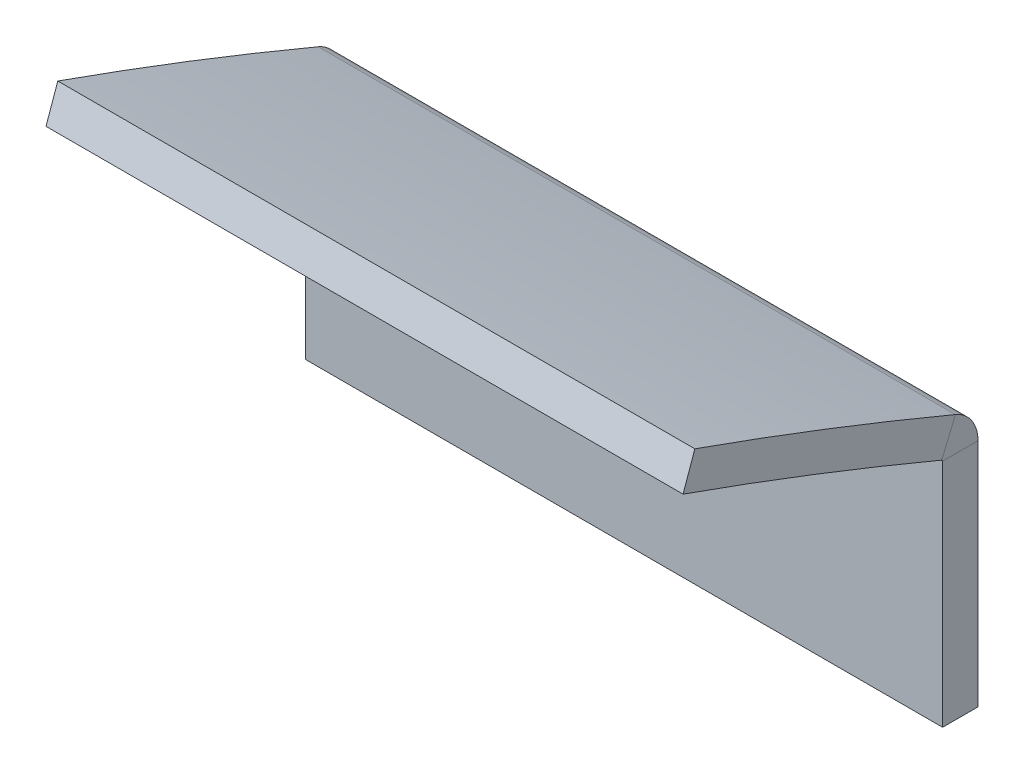
ISO-10303-21;
HEADER;
FILE_DESCRIPTION(('STEP AP214'),'2;1');
FILE_NAME('part.step','',(''),(''),'','','');
FILE_SCHEMA(('AUTOMOTIVE_DESIGN { 1 0 10303 214 1 1 1 1 }'));
ENDSEC;
DATA;
#1=APPLICATION_CONTEXT('core data for automotive mechanical design processes');
#2=APPLICATION_PROTOCOL_DEFINITION('international standard','automotive_design',2000,#1);
#3=PRODUCT_CONTEXT('',#1,'mechanical');
#4=PRODUCT('Part','Part','',(#3));
#5=PRODUCT_RELATED_PRODUCT_CATEGORY('part','',(#4));
#6=PRODUCT_DEFINITION_FORMATION('','',#4);
#7=PRODUCT_DEFINITION_CONTEXT('part definition',#1,'design');
#8=PRODUCT_DEFINITION('design','',#6,#7);
#9=PRODUCT_DEFINITION_SHAPE('','',#8);
#10=(LENGTH_UNIT() NAMED_UNIT(*) SI_UNIT(.MILLI.,.METRE.));
#11=(NAMED_UNIT(*) PLANE_ANGLE_UNIT() SI_UNIT($,.RADIAN.));
#12=(NAMED_UNIT(*) SI_UNIT($,.STERADIAN.) SOLID_ANGLE_UNIT());
#13=UNCERTAINTY_MEASURE_WITH_UNIT(LENGTH_MEASURE(1.E-05),#10,'distance_accuracy_value','');
#14=(GEOMETRIC_REPRESENTATION_CONTEXT(3) GLOBAL_UNCERTAINTY_ASSIGNED_CONTEXT((#13)) GLOBAL_UNIT_ASSIGNED_CONTEXT((#10,
#11,#12)) REPRESENTATION_CONTEXT('',''));
#15=CARTESIAN_POINT('',(0.,0.,0.));
#16=DIRECTION('',(0.,0.,1.));
#17=DIRECTION('',(1.,0.,0.));
#18=AXIS2_PLACEMENT_3D('',#15,#16,#17);
#19=CARTESIAN_POINT('',(14.2875,11.1016906738713,-5.58799999999883));
#20=DIRECTION('',(1.,0.,0.));
#21=DIRECTION('',(0.,0.,-1.));
#22=AXIS2_PLACEMENT_3D('',#19,#20,#21);
#23=PLANE('',#22);
#24=DIRECTION('',(0.,0.,1.));
#25=VECTOR('',#24,1.);
#26=CARTESIAN_POINT('',(14.2875,11.1016906738713,-5.58799999999883));
#27=LINE('',#26,#25);
#28=CARTESIAN_POINT('',(14.2875,11.1016906738713,-5.58799999999883));
#29=VERTEX_POINT('',#28);
#30=CARTESIAN_POINT('',(14.2875,11.1016906738713,-4.00049999999882));
#31=VERTEX_POINT('',#30);
#32=EDGE_CURVE('E11',#29,#31,#27,.T.);
#33=ORIENTED_EDGE('',*,*,#32,.F.);
#34=CARTESIAN_POINT('',(14.2875,11.1016906738713,-3.93699999999886));
#35=DIRECTION('',(1.,0.,0.));
#36=DIRECTION('',(0.,0.,-1.));
#37=AXIS2_PLACEMENT_3D('',#34,#35,#36);
#38=CIRCLE('',#37,1.65099999999996);
#39=CARTESIAN_POINT('',(14.2875,12.6242365890948,-4.57547861047536));
#40=VERTEX_POINT('',#39);
#41=EDGE_CURVE('E125',#29,#40,#38,.T.);
#42=ORIENTED_EDGE('',*,*,#41,.T.);
#43=DIRECTION('',(0.,-0.922196193351649,0.386722356436408));
#44=VECTOR('',#43,1.);
#45=CARTESIAN_POINT('',(14.2875,12.6242365890948,-4.57547861047536));
#46=LINE('',#45,#44);
#47=CARTESIAN_POINT('',(14.2875,11.1602501321491,-3.96155686963257));
#48=VERTEX_POINT('',#47);
#49=EDGE_CURVE('E51',#40,#48,#46,.T.);
#50=ORIENTED_EDGE('',*,*,#49,.T.);
#51=CARTESIAN_POINT('',(14.2875,11.1016906738713,-3.93699999999886));
#52=DIRECTION('',(1.,0.,0.));
#53=DIRECTION('',(0.,0.,-1.));
#54=AXIS2_PLACEMENT_3D('',#51,#52,#53);
#55=CIRCLE('',#54,0.0634999999999646);
#56=EDGE_CURVE('E132',#31,#48,#55,.T.);
#57=ORIENTED_EDGE('',*,*,#56,.F.);
#58=EDGE_LOOP('',(#33,#42,#50,#57));
#59=FACE_BOUND('',#58,.T.);
#60=ADVANCED_FACE('F35',(#59),#23,.T.);
#61=CARTESIAN_POINT('',(-14.2875,11.1016906738713,-4.00049999999882));
#62=DIRECTION('',(-1.,0.,0.));
#63=DIRECTION('',(0.,0.,1.));
#64=AXIS2_PLACEMENT_3D('',#61,#62,#63);
#65=PLANE('',#64);
#66=DIRECTION('',(0.,0.,-1.));
#67=VECTOR('',#66,1.);
#68=CARTESIAN_POINT('',(-14.2875,11.1016906738713,-4.00049999999882));
#69=LINE('',#68,#67);
#70=CARTESIAN_POINT('',(-14.2875,11.1016906738713,-4.00049999999882));
#71=VERTEX_POINT('',#70);
#72=CARTESIAN_POINT('',(-14.2875,11.1016906738713,-5.58799999999883));
#73=VERTEX_POINT('',#72);
#74=EDGE_CURVE('E43',#71,#73,#69,.T.);
#75=ORIENTED_EDGE('',*,*,#74,.F.);
#76=CARTESIAN_POINT('',(-14.2875,11.1016906738713,-3.93699999999886));
#77=DIRECTION('',(1.,0.,0.));
#78=DIRECTION('',(0.,0.,-1.));
#79=AXIS2_PLACEMENT_3D('',#76,#77,#78);
#80=CIRCLE('',#79,0.0634999999999646);
#81=CARTESIAN_POINT('',(-14.2875,11.1602501321491,-3.96155686963257));
#82=VERTEX_POINT('',#81);
#83=EDGE_CURVE('E147',#71,#82,#80,.T.);
#84=ORIENTED_EDGE('',*,*,#83,.T.);
#85=DIRECTION('',(0.,0.922196193351649,-0.386722356436408));
#86=VECTOR('',#85,1.);
#87=CARTESIAN_POINT('',(-14.2875,11.1602501321491,-3.96155686963257));
#88=LINE('',#87,#86);
#89=CARTESIAN_POINT('',(-14.2875,12.6242365890948,-4.57547861047536));
#90=VERTEX_POINT('',#89);
#91=EDGE_CURVE('E86',#82,#90,#88,.T.);
#92=ORIENTED_EDGE('',*,*,#91,.T.);
#93=CARTESIAN_POINT('',(-14.2875,11.1016906738713,-3.93699999999886));
#94=DIRECTION('',(1.,0.,0.));
#95=DIRECTION('',(0.,0.,-1.));
#96=AXIS2_PLACEMENT_3D('',#93,#94,#95);
#97=CIRCLE('',#96,1.65099999999996);
#98=EDGE_CURVE('E154',#73,#90,#97,.T.);
#99=ORIENTED_EDGE('',*,*,#98,.F.);
#100=EDGE_LOOP('',(#75,#84,#92,#99));
#101=FACE_BOUND('',#100,.T.);
#102=ADVANCED_FACE('F201',(#101),#65,.T.);
#103=CARTESIAN_POINT('',(14.2875,12.6242365890948,-4.57547861047536));
#104=DIRECTION('',(1.,0.,0.));
#105=DIRECTION('',(0.,0.,-1.));
#106=AXIS2_PLACEMENT_3D('',#103,#104,#105);
#107=PLANE('',#106);
#108=ORIENTED_EDGE('',*,*,#49,.F.);
#109=CARTESIAN_POINT('',(14.2875,-189.082246341472,80.0100000000011));
#110=DIRECTION('',(1.,0.,0.));
#111=DIRECTION('',(0.,0.,-1.));
#112=AXIS2_PLACEMENT_3D('',#109,#110,#111);
#113=CIRCLE('',#112,218.724046341463);
#114=CARTESIAN_POINT('',(14.2875,17.136302882361,7.11200000000116));
#115=VERTEX_POINT('',#114);
#116=EDGE_CURVE('E92',#40,#115,#113,.T.);
#117=ORIENTED_EDGE('',*,*,#116,.T.);
#118=DIRECTION('',(0.,0.94282522965899,-0.333287542999245));
#119=VECTOR('',#118,1.);
#120=CARTESIAN_POINT('',(14.2875,15.6395678302773,7.64109397451246));
#121=LINE('',#120,#119);
#122=CARTESIAN_POINT('',(14.2875,15.6395678302773,7.64109397451246));
#123=VERTEX_POINT('',#122);
#124=EDGE_CURVE('E185',#123,#115,#121,.T.);
#125=ORIENTED_EDGE('',*,*,#124,.F.);
#126=CARTESIAN_POINT('',(14.2875,-189.082246341472,80.0100000000011));
#127=DIRECTION('',(1.,0.,0.));
#128=DIRECTION('',(0.,0.,-1.));
#129=AXIS2_PLACEMENT_3D('',#126,#127,#128);
#130=CIRCLE('',#129,217.136546341463);
#131=EDGE_CURVE('E180',#48,#123,#130,.T.);
#132=ORIENTED_EDGE('',*,*,#131,.F.);
#133=EDGE_LOOP('',(#108,#117,#125,#132));
#134=FACE_BOUND('',#133,.T.);
#135=ADVANCED_FACE('F183',(#134),#107,.T.);
#136=CARTESIAN_POINT('',(-14.2875,11.1602501321491,-3.96155686963257));
#137=DIRECTION('',(-1.,0.,0.));
#138=DIRECTION('',(0.,0.,1.));
#139=AXIS2_PLACEMENT_3D('',#136,#137,#138);
#140=PLANE('',#139);
#141=ORIENTED_EDGE('',*,*,#91,.F.);
#142=CARTESIAN_POINT('',(-14.2875,-189.082246341472,80.0100000000011));
#143=DIRECTION('',(1.,0.,0.));
#144=DIRECTION('',(0.,0.,-1.));
#145=AXIS2_PLACEMENT_3D('',#142,#143,#144);
#146=CIRCLE('',#145,217.136546341463);
#147=CARTESIAN_POINT('',(-14.2875,15.6395678302773,7.64109397451246));
#148=VERTEX_POINT('',#147);
#149=EDGE_CURVE('E144',#82,#148,#146,.T.);
#150=ORIENTED_EDGE('',*,*,#149,.T.);
#151=DIRECTION('',(0.,0.94282522965899,-0.333287542999245));
#152=VECTOR('',#151,1.);
#153=CARTESIAN_POINT('',(-14.2875,15.6395678302773,7.64109397451246));
#154=LINE('',#153,#152);
#155=CARTESIAN_POINT('',(-14.2875,17.136302882361,7.11200000000116));
#156=VERTEX_POINT('',#155);
#157=EDGE_CURVE('E141',#148,#156,#154,.T.);
#158=ORIENTED_EDGE('',*,*,#157,.T.);
#159=CARTESIAN_POINT('',(-14.2875,-189.082246341472,80.0100000000011));
#160=DIRECTION('',(1.,0.,0.));
#161=DIRECTION('',(0.,0.,-1.));
#162=AXIS2_PLACEMENT_3D('',#159,#160,#161);
#163=CIRCLE('',#162,218.724046341463);
#164=EDGE_CURVE('E138',#90,#156,#163,.T.);
#165=ORIENTED_EDGE('',*,*,#164,.F.);
#166=EDGE_LOOP('',(#141,#150,#158,#165));
#167=FACE_BOUND('',#166,.T.);
#168=ADVANCED_FACE('F196',(#167),#140,.T.);
#169=CARTESIAN_POINT('',(14.2875,-189.082246341472,80.0100000000011));
#170=DIRECTION('',(-1.,0.,0.));
#171=DIRECTION('',(0.,0.,1.));
#172=AXIS2_PLACEMENT_3D('',#169,#170,#171);
#173=CYLINDRICAL_SURFACE('',#172,218.724046341463);
#174=ORIENTED_EDGE('',*,*,#164,.T.);
#175=DIRECTION('',(-1.,0.,0.));
#176=VECTOR('',#175,1.);
#177=CARTESIAN_POINT('',(14.2875,17.136302882361,7.11200000000116));
#178=LINE('',#177,#176);
#179=EDGE_CURVE('E168',#115,#156,#178,.T.);
#180=ORIENTED_EDGE('',*,*,#179,.F.);
#181=ORIENTED_EDGE('',*,*,#116,.F.);
#182=DIRECTION('',(-1.,0.,0.));
#183=VECTOR('',#182,1.);
#184=CARTESIAN_POINT('',(14.2875,12.6242365890948,-4.57547861047536));
#185=LINE('',#184,#183);
#186=EDGE_CURVE('E137',#40,#90,#185,.T.);
#187=ORIENTED_EDGE('',*,*,#186,.T.);
#188=EDGE_LOOP('',(#174,#180,#181,#187));
#189=FACE_BOUND('',#188,.T.);
#190=ADVANCED_FACE('F198',(#189),#173,.T.);
#191=CARTESIAN_POINT('',(14.2875,15.6395678302773,7.64109397451246));
#192=DIRECTION('',(0.,0.333287542999245,0.94282522965899));
#193=DIRECTION('',(0.,-0.94282522965899,0.333287542999245));
#194=AXIS2_PLACEMENT_3D('',#191,#192,#193);
#195=PLANE('',#194);
#196=ORIENTED_EDGE('',*,*,#157,.F.);
#197=DIRECTION('',(-1.,0.,0.));
#198=VECTOR('',#197,1.);
#199=CARTESIAN_POINT('',(14.2875,15.6395678302773,7.64109397451246));
#200=LINE('',#199,#198);
#201=EDGE_CURVE('E166',#123,#148,#200,.T.);
#202=ORIENTED_EDGE('',*,*,#201,.F.);
#203=ORIENTED_EDGE('',*,*,#124,.T.);
#204=ORIENTED_EDGE('',*,*,#179,.T.);
#205=EDGE_LOOP('',(#196,#202,#203,#204));
#206=FACE_BOUND('',#205,.T.);
#207=ADVANCED_FACE('F193',(#206),#195,.T.);
#208=CARTESIAN_POINT('',(14.2875,-189.082246341472,80.0100000000011));
#209=DIRECTION('',(-1.,0.,0.));
#210=DIRECTION('',(0.,0.,1.));
#211=AXIS2_PLACEMENT_3D('',#208,#209,#210);
#212=CYLINDRICAL_SURFACE('',#211,217.136546341463);
#213=ORIENTED_EDGE('',*,*,#149,.F.);
#214=DIRECTION('',(-1.,0.,0.));
#215=VECTOR('',#214,1.);
#216=CARTESIAN_POINT('',(14.2875,11.1602501321491,-3.96155686963257));
#217=LINE('',#216,#215);
#218=EDGE_CURVE('E163',#48,#82,#217,.T.);
#219=ORIENTED_EDGE('',*,*,#218,.F.);
#220=ORIENTED_EDGE('',*,*,#131,.T.);
#221=ORIENTED_EDGE('',*,*,#201,.T.);
#222=EDGE_LOOP('',(#213,#219,#220,#221));
#223=FACE_BOUND('',#222,.T.);
#224=ADVANCED_FACE('F179',(#223),#212,.F.);
#225=CARTESIAN_POINT('',(14.2875,11.1016906738713,-3.93699999999886));
#226=DIRECTION('',(-1.,0.,0.));
#227=DIRECTION('',(0.,0.,1.));
#228=AXIS2_PLACEMENT_3D('',#225,#226,#227);
#229=CYLINDRICAL_SURFACE('',#228,0.0634999999999646);
#230=ORIENTED_EDGE('',*,*,#83,.F.);
#231=DIRECTION('',(-1.,0.,0.));
#232=VECTOR('',#231,1.);
#233=CARTESIAN_POINT('',(14.2875,11.1016906738713,-4.00049999999882));
#234=LINE('',#233,#232);
#235=EDGE_CURVE('E160',#31,#71,#234,.T.);
#236=ORIENTED_EDGE('',*,*,#235,.F.);
#237=ORIENTED_EDGE('',*,*,#56,.T.);
#238=ORIENTED_EDGE('',*,*,#218,.T.);
#239=EDGE_LOOP('',(#230,#236,#237,#238));
#240=FACE_BOUND('',#239,.T.);
#241=ADVANCED_FACE('F188',(#240),#229,.F.);
#242=CARTESIAN_POINT('',(14.2875,0.762000000000197,-4.00049999999887));
#243=DIRECTION('',(0.,0.,1.));
#244=DIRECTION('',(0.,-1.,0.));
#245=AXIS2_PLACEMENT_3D('',#242,#243,#244);
#246=PLANE('',#245);
#247=DIRECTION('',(0.,1.,0.));
#248=VECTOR('',#247,1.);
#249=CARTESIAN_POINT('',(-14.2875,0.762000000000197,-4.00049999999887));
#250=LINE('',#249,#248);
#251=CARTESIAN_POINT('',(-14.2875,0.762000000000197,-4.00049999999887));
#252=VERTEX_POINT('',#251);
#253=EDGE_CURVE('E149',#252,#71,#250,.T.);
#254=ORIENTED_EDGE('',*,*,#253,.F.);
#255=DIRECTION('',(-1.,0.,0.));
#256=VECTOR('',#255,1.);
#257=CARTESIAN_POINT('',(14.2875,0.762000000000197,-4.00049999999887));
#258=LINE('',#257,#256);
#259=CARTESIAN_POINT('',(14.2875,0.762000000000197,-4.00049999999887));
#260=VERTEX_POINT('',#259);
#261=EDGE_CURVE('E115',#260,#252,#258,.T.);
#262=ORIENTED_EDGE('',*,*,#261,.F.);
#263=DIRECTION('',(0.,1.,0.));
#264=VECTOR('',#263,1.);
#265=CARTESIAN_POINT('',(14.2875,0.762000000000197,-4.00049999999887));
#266=LINE('',#265,#264);
#267=EDGE_CURVE('E130',#260,#31,#266,.T.);
#268=ORIENTED_EDGE('',*,*,#267,.T.);
#269=ORIENTED_EDGE('',*,*,#235,.T.);
#270=EDGE_LOOP('',(#254,#262,#268,#269));
#271=FACE_BOUND('',#270,.T.);
#272=ADVANCED_FACE('F204',(#271),#246,.T.);
#273=CARTESIAN_POINT('',(14.2875,0.762000000000203,-5.58799999999887));
#274=DIRECTION('',(0.,-1.,0.));
#275=DIRECTION('',(0.,0.,-1.));
#276=AXIS2_PLACEMENT_3D('',#273,#274,#275);
#277=PLANE('',#276);
#278=DIRECTION('',(0.,0.,1.));
#279=VECTOR('',#278,1.);
#280=CARTESIAN_POINT('',(-14.2875,0.762000000000203,-5.58799999999887));
#281=LINE('',#280,#279);
#282=CARTESIAN_POINT('',(-14.2875,0.762000000000203,-5.58799999999887));
#283=VERTEX_POINT('',#282);
#284=EDGE_CURVE('E113',#283,#252,#281,.T.);
#285=ORIENTED_EDGE('',*,*,#284,.F.);
#286=DIRECTION('',(-1.,0.,0.));
#287=VECTOR('',#286,1.);
#288=CARTESIAN_POINT('',(14.2875,0.762000000000203,-5.58799999999887));
#289=LINE('',#288,#287);
#290=CARTESIAN_POINT('',(14.2875,0.762000000000203,-5.58799999999887));
#291=VERTEX_POINT('',#290);
#292=EDGE_CURVE('E107',#291,#283,#289,.T.);
#293=ORIENTED_EDGE('',*,*,#292,.F.);
#294=DIRECTION('',(0.,0.,1.));
#295=VECTOR('',#294,1.);
#296=CARTESIAN_POINT('',(14.2875,0.762000000000203,-5.58799999999887));
#297=LINE('',#296,#295);
#298=EDGE_CURVE('E111',#291,#260,#297,.T.);
#299=ORIENTED_EDGE('',*,*,#298,.T.);
#300=ORIENTED_EDGE('',*,*,#261,.T.);
#301=EDGE_LOOP('',(#285,#293,#299,#300));
#302=FACE_BOUND('',#301,.T.);
#303=ADVANCED_FACE('F109',(#302),#277,.T.);
#304=CARTESIAN_POINT('',(14.2875,0.762000000000203,-5.58799999999887));
#305=DIRECTION('',(0.,0.,1.));
#306=DIRECTION('',(0.,-1.,0.));
#307=AXIS2_PLACEMENT_3D('',#304,#305,#306);
#308=PLANE('',#307);
#309=DIRECTION('',(0.,1.,0.));
#310=VECTOR('',#309,1.);
#311=CARTESIAN_POINT('',(-14.2875,0.762000000000203,-5.58799999999887));
#312=LINE('',#311,#310);
#313=EDGE_CURVE('E152',#283,#73,#312,.T.);
#314=ORIENTED_EDGE('',*,*,#313,.T.);
#315=DIRECTION('',(-1.,0.,0.));
#316=VECTOR('',#315,1.);
#317=CARTESIAN_POINT('',(14.2875,11.1016906738713,-5.58799999999883));
#318=LINE('',#317,#316);
#319=EDGE_CURVE('E116',#29,#73,#318,.T.);
#320=ORIENTED_EDGE('',*,*,#319,.F.);
#321=DIRECTION('',(0.,1.,0.));
#322=VECTOR('',#321,1.);
#323=CARTESIAN_POINT('',(14.2875,0.762000000000203,-5.58799999999887));
#324=LINE('',#323,#322);
#325=EDGE_CURVE('E120',#291,#29,#324,.T.);
#326=ORIENTED_EDGE('',*,*,#325,.F.);
#327=ORIENTED_EDGE('',*,*,#292,.T.);
#328=EDGE_LOOP('',(#314,#320,#326,#327));
#329=FACE_BOUND('',#328,.T.);
#330=ADVANCED_FACE('F121',(#329),#308,.F.);
#331=CARTESIAN_POINT('',(14.2875,11.1016906738713,-3.93699999999886));
#332=DIRECTION('',(-1.,0.,0.));
#333=DIRECTION('',(0.,0.,1.));
#334=AXIS2_PLACEMENT_3D('',#331,#332,#333);
#335=CYLINDRICAL_SURFACE('',#334,1.65099999999996);
#336=ORIENTED_EDGE('',*,*,#98,.T.);
#337=ORIENTED_EDGE('',*,*,#186,.F.);
#338=ORIENTED_EDGE('',*,*,#41,.F.);
#339=ORIENTED_EDGE('',*,*,#319,.T.);
#340=EDGE_LOOP('',(#336,#337,#338,#339));
#341=FACE_BOUND('',#340,.T.);
#342=ADVANCED_FACE('F200',(#341),#335,.T.);
#343=CARTESIAN_POINT('',(14.2875,-189.082246341472,80.0100000000011));
#344=DIRECTION('',(1.,0.,0.));
#345=DIRECTION('',(0.,0.,-1.));
#346=AXIS2_PLACEMENT_3D('',#343,#344,#345);
#347=PLANE('',#346);
#348=ORIENTED_EDGE('',*,*,#325,.T.);
#349=ORIENTED_EDGE('',*,*,#32,.T.);
#350=ORIENTED_EDGE('',*,*,#267,.F.);
#351=ORIENTED_EDGE('',*,*,#298,.F.);
#352=EDGE_LOOP('',(#348,#349,#350,#351));
#353=FACE_BOUND('',#352,.T.);
#354=ADVANCED_FACE('F128',(#353),#347,.T.);
#355=CARTESIAN_POINT('',(-14.2875,-189.082246341472,80.0100000000011));
#356=DIRECTION('',(1.,0.,0.));
#357=DIRECTION('',(0.,0.,-1.));
#358=AXIS2_PLACEMENT_3D('',#355,#356,#357);
#359=PLANE('',#358);
#360=ORIENTED_EDGE('',*,*,#253,.T.);
#361=ORIENTED_EDGE('',*,*,#74,.T.);
#362=ORIENTED_EDGE('',*,*,#313,.F.);
#363=ORIENTED_EDGE('',*,*,#284,.T.);
#364=EDGE_LOOP('',(#360,#361,#362,#363));
#365=FACE_BOUND('',#364,.T.);
#366=ADVANCED_FACE('F205',(#365),#359,.F.);
#367=CLOSED_SHELL('',(#60,#102,#135,#168,#190,#207,#224,#241,#272,#303,#330,#342,#354,#366));
#368=MANIFOLD_SOLID_BREP('B2',#367);
#369=ADVANCED_BREP_SHAPE_REPRESENTATION('',(#18,#368),#14);
#370=SHAPE_DEFINITION_REPRESENTATION(#9,#369);
ENDSEC;
END-ISO-10303-21;
